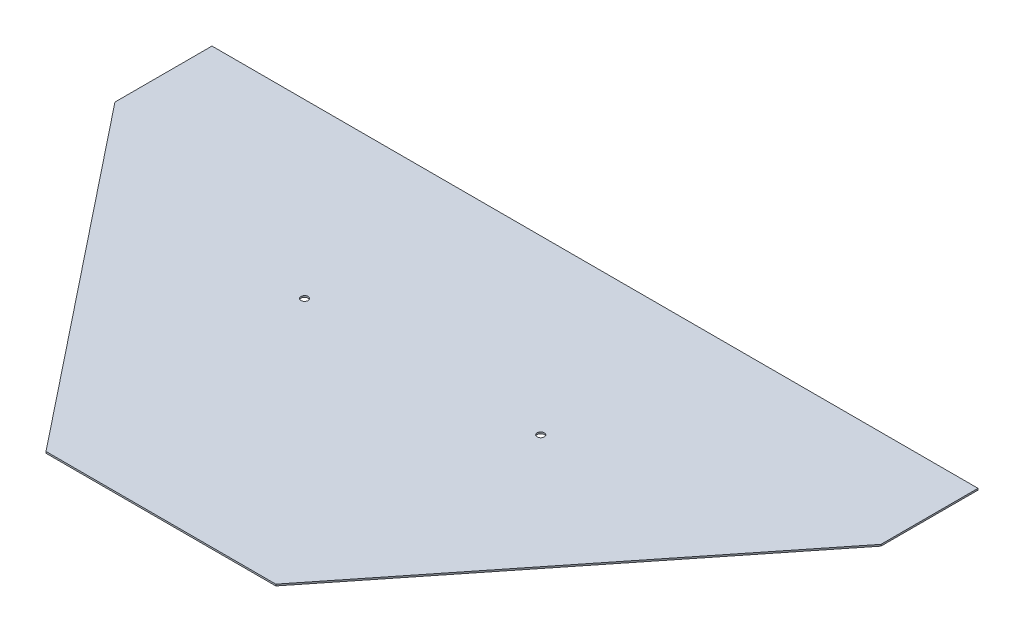
ISO-10303-21;
HEADER;
FILE_DESCRIPTION(('STEP AP214'),'2;1');
FILE_NAME('part.step','',(''),(''),'','','');
FILE_SCHEMA(('AUTOMOTIVE_DESIGN { 1 0 10303 214 1 1 1 1 }'));
ENDSEC;
DATA;
#1=APPLICATION_CONTEXT('core data for automotive mechanical design processes');
#2=APPLICATION_PROTOCOL_DEFINITION('international standard','automotive_design',2000,#1);
#3=PRODUCT_CONTEXT('',#1,'mechanical');
#4=PRODUCT('Part','Part','',(#3));
#5=PRODUCT_RELATED_PRODUCT_CATEGORY('part','',(#4));
#6=PRODUCT_DEFINITION_FORMATION('','',#4);
#7=PRODUCT_DEFINITION_CONTEXT('part definition',#1,'design');
#8=PRODUCT_DEFINITION('design','',#6,#7);
#9=PRODUCT_DEFINITION_SHAPE('','',#8);
#10=(LENGTH_UNIT() NAMED_UNIT(*) SI_UNIT(.MILLI.,.METRE.));
#11=(NAMED_UNIT(*) PLANE_ANGLE_UNIT() SI_UNIT($,.RADIAN.));
#12=(NAMED_UNIT(*) SI_UNIT($,.STERADIAN.) SOLID_ANGLE_UNIT());
#13=UNCERTAINTY_MEASURE_WITH_UNIT(LENGTH_MEASURE(1.E-05),#10,'distance_accuracy_value','');
#14=(GEOMETRIC_REPRESENTATION_CONTEXT(3) GLOBAL_UNCERTAINTY_ASSIGNED_CONTEXT((#13)) GLOBAL_UNIT_ASSIGNED_CONTEXT((#10,
#11,#12)) REPRESENTATION_CONTEXT('',''));
#15=CARTESIAN_POINT('',(0.,0.,0.));
#16=DIRECTION('',(0.,0.,1.));
#17=DIRECTION('',(1.,0.,0.));
#18=AXIS2_PLACEMENT_3D('',#15,#16,#17);
#19=CARTESIAN_POINT('',(-533.4,3.175,-670.56));
#20=DIRECTION('',(0.782601054175648,0.,-0.622523565821539));
#21=DIRECTION('',(-0.622523565821539,0.,-0.782601054175649));
#22=AXIS2_PLACEMENT_3D('',#19,#20,#21);
#23=PLANE('',#22);
#24=DIRECTION('',(0.622523565821539,0.,0.782601054175648));
#25=VECTOR('',#24,1.);
#26=CARTESIAN_POINT('',(-533.4,0.,-670.56));
#27=LINE('',#26,#25);
#28=CARTESIAN_POINT('',(-533.4,0.,-670.56));
#29=VERTEX_POINT('',#28);
#30=CARTESIAN_POINT('',(0.,0.,0.));
#31=VERTEX_POINT('',#30);
#32=EDGE_CURVE('E101',#29,#31,#27,.T.);
#33=ORIENTED_EDGE('',*,*,#32,.T.);
#34=DIRECTION('',(0.,-1.,0.));
#35=VECTOR('',#34,1.);
#36=CARTESIAN_POINT('',(0.,3.175,0.));
#37=LINE('',#36,#35);
#38=CARTESIAN_POINT('',(0.,3.175,0.));
#39=VERTEX_POINT('',#38);
#40=EDGE_CURVE('E11',#39,#31,#37,.T.);
#41=ORIENTED_EDGE('',*,*,#40,.F.);
#42=DIRECTION('',(0.622523565821539,0.,0.782601054175648));
#43=VECTOR('',#42,1.);
#44=CARTESIAN_POINT('',(-533.4,3.175,-670.56));
#45=LINE('',#44,#43);
#46=CARTESIAN_POINT('',(-533.4,3.175,-670.56));
#47=VERTEX_POINT('',#46);
#48=EDGE_CURVE('E112',#47,#39,#45,.T.);
#49=ORIENTED_EDGE('',*,*,#48,.F.);
#50=DIRECTION('',(0.,-1.,0.));
#51=VECTOR('',#50,1.);
#52=CARTESIAN_POINT('',(-533.4,3.175,-670.56));
#53=LINE('',#52,#51);
#54=EDGE_CURVE('E97',#47,#29,#53,.T.);
#55=ORIENTED_EDGE('',*,*,#54,.T.);
#56=EDGE_LOOP('',(#33,#41,#49,#55));
#57=FACE_BOUND('',#56,.T.);
#58=ADVANCED_FACE('F17',(#57),#23,.F.);
#59=CARTESIAN_POINT('',(0.,3.175,0.));
#60=DIRECTION('',(0.,0.,-1.));
#61=DIRECTION('',(-1.,0.,0.));
#62=AXIS2_PLACEMENT_3D('',#59,#60,#61);
#63=PLANE('',#62);
#64=DIRECTION('',(1.,0.,0.));
#65=VECTOR('',#64,1.);
#66=CARTESIAN_POINT('',(0.,0.,0.));
#67=LINE('',#66,#65);
#68=CARTESIAN_POINT('',(457.2,0.,0.));
#69=VERTEX_POINT('',#68);
#70=EDGE_CURVE('E104',#31,#69,#67,.T.);
#71=ORIENTED_EDGE('',*,*,#70,.T.);
#72=DIRECTION('',(0.,-1.,0.));
#73=VECTOR('',#72,1.);
#74=CARTESIAN_POINT('',(457.2,3.175,0.));
#75=LINE('',#74,#73);
#76=CARTESIAN_POINT('',(457.2,3.175,0.));
#77=VERTEX_POINT('',#76);
#78=EDGE_CURVE('E25',#77,#69,#75,.T.);
#79=ORIENTED_EDGE('',*,*,#78,.F.);
#80=DIRECTION('',(1.,0.,0.));
#81=VECTOR('',#80,1.);
#82=CARTESIAN_POINT('',(0.,3.175,0.));
#83=LINE('',#82,#81);
#84=EDGE_CURVE('E70',#39,#77,#83,.T.);
#85=ORIENTED_EDGE('',*,*,#84,.F.);
#86=ORIENTED_EDGE('',*,*,#40,.T.);
#87=EDGE_LOOP('',(#71,#79,#85,#86));
#88=FACE_BOUND('',#87,.T.);
#89=ADVANCED_FACE('F139',(#88),#63,.F.);
#90=CARTESIAN_POINT('',(457.2,3.175,0.));
#91=DIRECTION('',(-0.782601054175648,0.,-0.622523565821539));
#92=DIRECTION('',(-0.622523565821539,0.,0.782601054175649));
#93=AXIS2_PLACEMENT_3D('',#90,#91,#92);
#94=PLANE('',#93);
#95=DIRECTION('',(0.622523565821539,0.,-0.782601054175648));
#96=VECTOR('',#95,1.);
#97=CARTESIAN_POINT('',(457.2,0.,0.));
#98=LINE('',#97,#96);
#99=CARTESIAN_POINT('',(990.6,0.,-670.56));
#100=VERTEX_POINT('',#99);
#101=EDGE_CURVE('E107',#69,#100,#98,.T.);
#102=ORIENTED_EDGE('',*,*,#101,.T.);
#103=DIRECTION('',(0.,-1.,0.));
#104=VECTOR('',#103,1.);
#105=CARTESIAN_POINT('',(990.6,3.175,-670.56));
#106=LINE('',#105,#104);
#107=CARTESIAN_POINT('',(990.6,3.175,-670.56));
#108=VERTEX_POINT('',#107);
#109=EDGE_CURVE('E92',#108,#100,#106,.T.);
#110=ORIENTED_EDGE('',*,*,#109,.F.);
#111=DIRECTION('',(0.622523565821539,0.,-0.782601054175648));
#112=VECTOR('',#111,1.);
#113=CARTESIAN_POINT('',(457.2,3.175,0.));
#114=LINE('',#113,#112);
#115=EDGE_CURVE('E83',#77,#108,#114,.T.);
#116=ORIENTED_EDGE('',*,*,#115,.F.);
#117=ORIENTED_EDGE('',*,*,#78,.T.);
#118=EDGE_LOOP('',(#102,#110,#116,#117));
#119=FACE_BOUND('',#118,.T.);
#120=ADVANCED_FACE('F118',(#119),#94,.F.);
#121=CARTESIAN_POINT('',(990.6,3.175,-670.56));
#122=DIRECTION('',(-1.,0.,0.));
#123=DIRECTION('',(0.,0.,1.));
#124=AXIS2_PLACEMENT_3D('',#121,#122,#123);
#125=PLANE('',#124);
#126=DIRECTION('',(0.,0.,-1.));
#127=VECTOR('',#126,1.);
#128=CARTESIAN_POINT('',(990.6,0.,-670.56));
#129=LINE('',#128,#127);
#130=CARTESIAN_POINT('',(990.6,0.,-863.6));
#131=VERTEX_POINT('',#130);
#132=EDGE_CURVE('E91',#100,#131,#129,.T.);
#133=ORIENTED_EDGE('',*,*,#132,.T.);
#134=DIRECTION('',(0.,-1.,0.));
#135=VECTOR('',#134,1.);
#136=CARTESIAN_POINT('',(990.6,3.175,-863.6));
#137=LINE('',#136,#135);
#138=CARTESIAN_POINT('',(990.6,3.175,-863.6));
#139=VERTEX_POINT('',#138);
#140=EDGE_CURVE('E88',#139,#131,#137,.T.);
#141=ORIENTED_EDGE('',*,*,#140,.F.);
#142=DIRECTION('',(0.,0.,-1.));
#143=VECTOR('',#142,1.);
#144=CARTESIAN_POINT('',(990.6,3.175,-670.56));
#145=LINE('',#144,#143);
#146=EDGE_CURVE('E77',#108,#139,#145,.T.);
#147=ORIENTED_EDGE('',*,*,#146,.F.);
#148=ORIENTED_EDGE('',*,*,#109,.T.);
#149=EDGE_LOOP('',(#133,#141,#147,#148));
#150=FACE_BOUND('',#149,.T.);
#151=ADVANCED_FACE('F89',(#150),#125,.F.);
#152=CARTESIAN_POINT('',(990.6,3.175,-863.6));
#153=DIRECTION('',(0.,0.,1.));
#154=DIRECTION('',(1.,0.,0.));
#155=AXIS2_PLACEMENT_3D('',#152,#153,#154);
#156=PLANE('',#155);
#157=DIRECTION('',(-1.,0.,0.));
#158=VECTOR('',#157,1.);
#159=CARTESIAN_POINT('',(990.6,0.,-863.6));
#160=LINE('',#159,#158);
#161=CARTESIAN_POINT('',(-533.4,0.,-863.6));
#162=VERTEX_POINT('',#161);
#163=EDGE_CURVE('E56',#131,#162,#160,.T.);
#164=ORIENTED_EDGE('',*,*,#163,.T.);
#165=DIRECTION('',(0.,-1.,0.));
#166=VECTOR('',#165,1.);
#167=CARTESIAN_POINT('',(-533.4,3.175,-863.6));
#168=LINE('',#167,#166);
#169=CARTESIAN_POINT('',(-533.4,3.175,-863.6));
#170=VERTEX_POINT('',#169);
#171=EDGE_CURVE('E93',#170,#162,#168,.T.);
#172=ORIENTED_EDGE('',*,*,#171,.F.);
#173=DIRECTION('',(-1.,0.,0.));
#174=VECTOR('',#173,1.);
#175=CARTESIAN_POINT('',(990.6,3.175,-863.6));
#176=LINE('',#175,#174);
#177=EDGE_CURVE('E81',#139,#170,#176,.T.);
#178=ORIENTED_EDGE('',*,*,#177,.F.);
#179=ORIENTED_EDGE('',*,*,#140,.T.);
#180=EDGE_LOOP('',(#164,#172,#178,#179));
#181=FACE_BOUND('',#180,.T.);
#182=ADVANCED_FACE('F95',(#181),#156,.F.);
#183=CARTESIAN_POINT('',(-533.4,3.175,-863.6));
#184=DIRECTION('',(1.,0.,0.));
#185=DIRECTION('',(0.,0.,-1.));
#186=AXIS2_PLACEMENT_3D('',#183,#184,#185);
#187=PLANE('',#186);
#188=DIRECTION('',(0.,0.,1.));
#189=VECTOR('',#188,1.);
#190=CARTESIAN_POINT('',(-533.4,0.,-863.6));
#191=LINE('',#190,#189);
#192=EDGE_CURVE('E62',#162,#29,#191,.T.);
#193=ORIENTED_EDGE('',*,*,#192,.T.);
#194=ORIENTED_EDGE('',*,*,#54,.F.);
#195=DIRECTION('',(0.,0.,1.));
#196=VECTOR('',#195,1.);
#197=CARTESIAN_POINT('',(-533.4,3.175,-863.6));
#198=LINE('',#197,#196);
#199=EDGE_CURVE('E33',#170,#47,#198,.T.);
#200=ORIENTED_EDGE('',*,*,#199,.F.);
#201=ORIENTED_EDGE('',*,*,#171,.T.);
#202=EDGE_LOOP('',(#193,#194,#200,#201));
#203=FACE_BOUND('',#202,.T.);
#204=ADVANCED_FACE('F125',(#203),#187,.F.);
#205=CARTESIAN_POINT('',(228.6,3.175,287.382857142857));
#206=DIRECTION('',(0.,1.,0.));
#207=DIRECTION('',(0.,0.,1.));
#208=AXIS2_PLACEMENT_3D('',#205,#206,#207);
#209=PLANE('',#208);
#210=CARTESIAN_POINT('',(463.55,3.175,-520.7));
#211=DIRECTION('',(0.,1.,0.));
#212=DIRECTION('',(0.,0.,1.));
#213=AXIS2_PLACEMENT_3D('',#210,#211,#212);
#214=CIRCLE('',#213,7.14375);
#215=CARTESIAN_POINT('',(463.55,3.175,-513.55625));
#216=VERTEX_POINT('',#215);
#217=EDGE_CURVE('E213',#216,#216,#214,.T.);
#218=ORIENTED_EDGE('',*,*,#217,.F.);
#219=EDGE_LOOP('',(#218));
#220=FACE_BOUND('',#219,.T.);
#221=CARTESIAN_POINT('',(-6.35,3.175,-520.7));
#222=DIRECTION('',(0.,1.,0.));
#223=DIRECTION('',(0.,0.,1.));
#224=AXIS2_PLACEMENT_3D('',#221,#222,#223);
#225=CIRCLE('',#224,7.14374999999992);
#226=CARTESIAN_POINT('',(-6.35,3.175,-513.55625));
#227=VERTEX_POINT('',#226);
#228=EDGE_CURVE('E217',#227,#227,#225,.T.);
#229=ORIENTED_EDGE('',*,*,#228,.F.);
#230=EDGE_LOOP('',(#229));
#231=FACE_BOUND('',#230,.T.);
#232=ORIENTED_EDGE('',*,*,#48,.T.);
#233=ORIENTED_EDGE('',*,*,#84,.T.);
#234=ORIENTED_EDGE('',*,*,#115,.T.);
#235=ORIENTED_EDGE('',*,*,#146,.T.);
#236=ORIENTED_EDGE('',*,*,#177,.T.);
#237=ORIENTED_EDGE('',*,*,#199,.T.);
#238=EDGE_LOOP('',(#232,#233,#234,#235,#236,#237));
#239=FACE_BOUND('',#238,.T.);
#240=ADVANCED_FACE('F79',(#220,#231,#239),#209,.T.);
#241=CARTESIAN_POINT('',(228.6,0.,287.382857142857));
#242=DIRECTION('',(0.,1.,0.));
#243=DIRECTION('',(0.,0.,1.));
#244=AXIS2_PLACEMENT_3D('',#241,#242,#243);
#245=PLANE('',#244);
#246=CARTESIAN_POINT('',(463.55,0.,-520.7));
#247=DIRECTION('',(0.,1.,0.));
#248=DIRECTION('',(0.,0.,1.));
#249=AXIS2_PLACEMENT_3D('',#246,#247,#248);
#250=CIRCLE('',#249,7.14375);
#251=CARTESIAN_POINT('',(463.55,0.,-513.55625));
#252=VERTEX_POINT('',#251);
#253=EDGE_CURVE('E216',#252,#252,#250,.F.);
#254=ORIENTED_EDGE('',*,*,#253,.F.);
#255=EDGE_LOOP('',(#254));
#256=FACE_BOUND('',#255,.T.);
#257=CARTESIAN_POINT('',(-6.35,0.,-520.7));
#258=DIRECTION('',(0.,1.,0.));
#259=DIRECTION('',(0.,0.,1.));
#260=AXIS2_PLACEMENT_3D('',#257,#258,#259);
#261=CIRCLE('',#260,7.14374999999992);
#262=CARTESIAN_POINT('',(-6.35,0.,-513.55625));
#263=VERTEX_POINT('',#262);
#264=EDGE_CURVE('E105',#263,#263,#261,.F.);
#265=ORIENTED_EDGE('',*,*,#264,.F.);
#266=EDGE_LOOP('',(#265));
#267=FACE_BOUND('',#266,.T.);
#268=ORIENTED_EDGE('',*,*,#32,.F.);
#269=ORIENTED_EDGE('',*,*,#192,.F.);
#270=ORIENTED_EDGE('',*,*,#163,.F.);
#271=ORIENTED_EDGE('',*,*,#132,.F.);
#272=ORIENTED_EDGE('',*,*,#101,.F.);
#273=ORIENTED_EDGE('',*,*,#70,.F.);
#274=EDGE_LOOP('',(#268,#269,#270,#271,#272,#273));
#275=FACE_BOUND('',#274,.T.);
#276=ADVANCED_FACE('F121',(#256,#267,#275),#245,.F.);
#277=CARTESIAN_POINT('',(-6.35,-0.00100000000000013,-520.7));
#278=DIRECTION('',(0.,1.,0.));
#279=DIRECTION('',(0.,0.,1.));
#280=AXIS2_PLACEMENT_3D('',#277,#278,#279);
#281=CYLINDRICAL_SURFACE('',#280,7.14374999999992);
#282=ORIENTED_EDGE('',*,*,#228,.T.);
#283=EDGE_LOOP('',(#282));
#284=FACE_BOUND('',#283,.T.);
#285=ORIENTED_EDGE('',*,*,#264,.T.);
#286=EDGE_LOOP('',(#285));
#287=FACE_BOUND('',#286,.T.);
#288=ADVANCED_FACE('F185',(#284,#287),#281,.F.);
#289=CARTESIAN_POINT('',(463.55,-0.00100000000000013,-520.7));
#290=DIRECTION('',(0.,1.,0.));
#291=DIRECTION('',(0.,0.,1.));
#292=AXIS2_PLACEMENT_3D('',#289,#290,#291);
#293=CYLINDRICAL_SURFACE('',#292,7.14375);
#294=ORIENTED_EDGE('',*,*,#217,.T.);
#295=EDGE_LOOP('',(#294));
#296=FACE_BOUND('',#295,.T.);
#297=ORIENTED_EDGE('',*,*,#253,.T.);
#298=EDGE_LOOP('',(#297));
#299=FACE_BOUND('',#298,.T.);
#300=ADVANCED_FACE('F194',(#296,#299),#293,.F.);
#301=CLOSED_SHELL('',(#58,#89,#120,#151,#182,#204,#240,#276,#288,#300));
#302=MANIFOLD_SOLID_BREP('B1',#301);
#303=ADVANCED_BREP_SHAPE_REPRESENTATION('',(#18,#302),#14);
#304=SHAPE_DEFINITION_REPRESENTATION(#9,#303);
ENDSEC;
END-ISO-10303-21;
